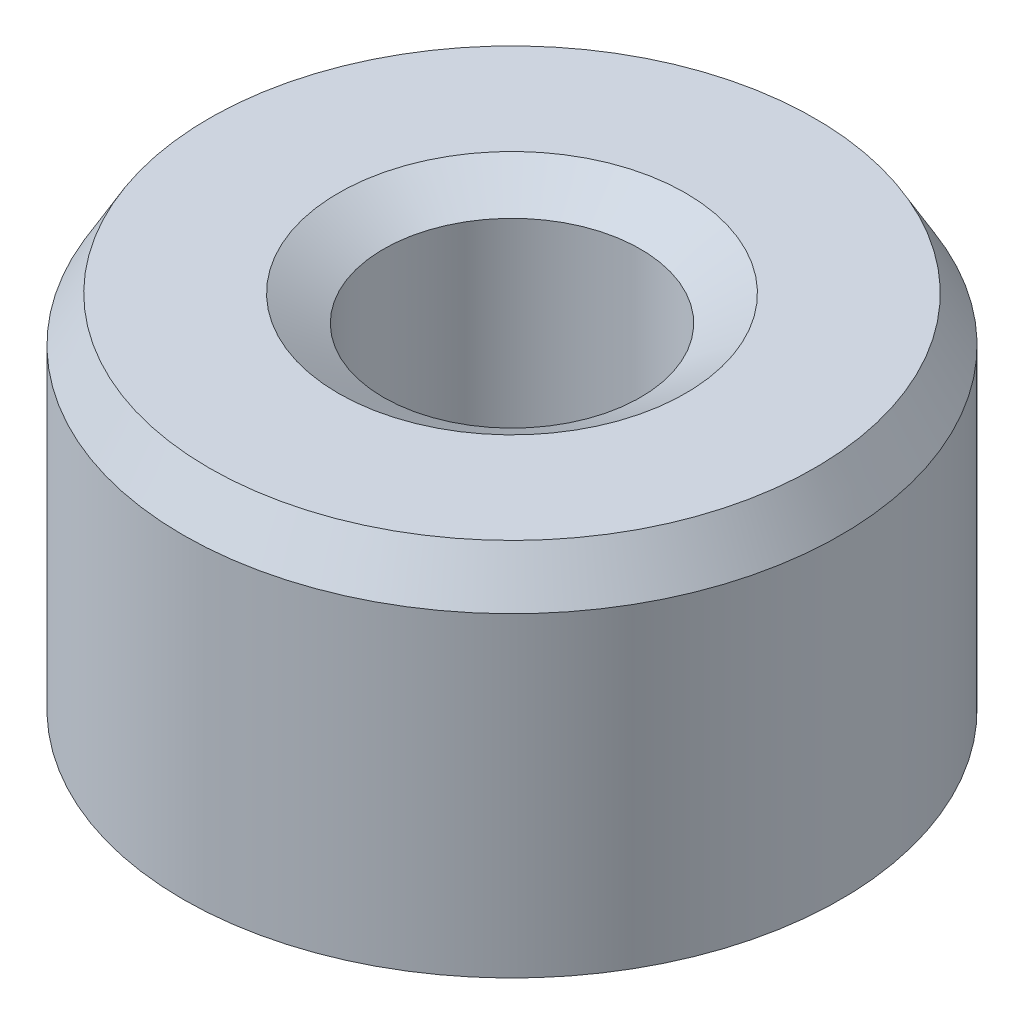
ISO-10303-21;
HEADER;
FILE_DESCRIPTION(('STEP AP214'),'2;1');
FILE_NAME('part.step','',(''),(''),'','','');
FILE_SCHEMA(('AUTOMOTIVE_DESIGN { 1 0 10303 214 1 1 1 1 }'));
ENDSEC;
DATA;
#1=APPLICATION_CONTEXT('core data for automotive mechanical design processes');
#2=APPLICATION_PROTOCOL_DEFINITION('international standard','automotive_design',2000,#1);
#3=PRODUCT_CONTEXT('',#1,'mechanical');
#4=PRODUCT('Part','Part','',(#3));
#5=PRODUCT_RELATED_PRODUCT_CATEGORY('part','',(#4));
#6=PRODUCT_DEFINITION_FORMATION('','',#4);
#7=PRODUCT_DEFINITION_CONTEXT('part definition',#1,'design');
#8=PRODUCT_DEFINITION('design','',#6,#7);
#9=PRODUCT_DEFINITION_SHAPE('','',#8);
#10=(LENGTH_UNIT() NAMED_UNIT(*) SI_UNIT(.MILLI.,.METRE.));
#11=(NAMED_UNIT(*) PLANE_ANGLE_UNIT() SI_UNIT($,.RADIAN.));
#12=(NAMED_UNIT(*) SI_UNIT($,.STERADIAN.) SOLID_ANGLE_UNIT());
#13=UNCERTAINTY_MEASURE_WITH_UNIT(LENGTH_MEASURE(1.E-05),#10,'distance_accuracy_value','');
#14=(GEOMETRIC_REPRESENTATION_CONTEXT(3) GLOBAL_UNCERTAINTY_ASSIGNED_CONTEXT((#13)) GLOBAL_UNIT_ASSIGNED_CONTEXT((#10,
#11,#12)) REPRESENTATION_CONTEXT('',''));
#15=CARTESIAN_POINT('',(0.,0.,0.));
#16=DIRECTION('',(0.,0.,1.));
#17=DIRECTION('',(1.,0.,0.));
#18=AXIS2_PLACEMENT_3D('',#15,#16,#17);
#19=CARTESIAN_POINT('',(0.,32.326275413145,0.));
#20=DIRECTION('',(0.,-1.,0.));
#21=DIRECTION('',(0.,0.,-1.));
#22=AXIS2_PLACEMENT_3D('',#19,#20,#21);
#23=CYLINDRICAL_SURFACE('',#22,27.5);
#24=CARTESIAN_POINT('',(0.,2.17567793763156,0.));
#25=DIRECTION('',(0.,1.,0.));
#26=DIRECTION('',(0.,0.,1.));
#27=AXIS2_PLACEMENT_3D('',#24,#25,#26);
#28=CIRCLE('',#27,27.5);
#29=CARTESIAN_POINT('',(0.,2.17567793763156,27.5));
#30=VERTEX_POINT('',#29);
#31=EDGE_CURVE('E10',#30,#30,#28,.T.);
#32=ORIENTED_EDGE('',*,*,#31,.T.);
#33=EDGE_LOOP('',(#32));
#34=FACE_BOUND('',#33,.T.);
#35=CARTESIAN_POINT('',(0.,28.5578906842604,0.));
#36=DIRECTION('',(0.,1.,0.));
#37=DIRECTION('',(0.,0.,1.));
#38=AXIS2_PLACEMENT_3D('',#35,#36,#37);
#39=CIRCLE('',#38,27.5);
#40=CARTESIAN_POINT('',(0.,28.5578906842604,27.5));
#41=VERTEX_POINT('',#40);
#42=EDGE_CURVE('E50',#41,#41,#39,.F.);
#43=ORIENTED_EDGE('',*,*,#42,.T.);
#44=EDGE_LOOP('',(#43));
#45=FACE_BOUND('',#44,.T.);
#46=ADVANCED_FACE('F39',(#34,#45),#23,.T.);
#47=CARTESIAN_POINT('',(0.,32.326275413145,0.));
#48=DIRECTION('',(0.,1.,0.));
#49=DIRECTION('',(0.,0.,1.));
#50=AXIS2_PLACEMENT_3D('',#47,#48,#49);
#51=PLANE('',#50);
#52=CARTESIAN_POINT('',(0.,32.326275413145,0.));
#53=DIRECTION('',(0.,1.,0.));
#54=DIRECTION('',(0.,0.,1.));
#55=AXIS2_PLACEMENT_3D('',#52,#53,#54);
#56=CIRCLE('',#55,14.5145012517158);
#57=CARTESIAN_POINT('',(0.,32.326275413145,14.5145012517158));
#58=VERTEX_POINT('',#57);
#59=EDGE_CURVE('E58',#58,#58,#56,.F.);
#60=ORIENTED_EDGE('',*,*,#59,.T.);
#61=EDGE_LOOP('',(#60));
#62=FACE_BOUND('',#61,.T.);
#63=CARTESIAN_POINT('',(0.,32.326275413145,0.));
#64=DIRECTION('',(0.,1.,0.));
#65=DIRECTION('',(0.,0.,1.));
#66=AXIS2_PLACEMENT_3D('',#63,#64,#65);
#67=CIRCLE('',#66,25.3243220623684);
#68=CARTESIAN_POINT('',(0.,32.326275413145,25.3243220623684));
#69=VERTEX_POINT('',#68);
#70=EDGE_CURVE('E61',#69,#69,#67,.T.);
#71=ORIENTED_EDGE('',*,*,#70,.T.);
#72=EDGE_LOOP('',(#71));
#73=FACE_BOUND('',#72,.T.);
#74=ADVANCED_FACE('F88',(#62,#73),#51,.T.);
#75=CARTESIAN_POINT('',(0.,0.,0.));
#76=DIRECTION('',(0.,1.,0.));
#77=DIRECTION('',(0.,0.,1.));
#78=AXIS2_PLACEMENT_3D('',#75,#76,#77);
#79=PLANE('',#78);
#80=CARTESIAN_POINT('',(0.,0.,0.));
#81=DIRECTION('',(0.,1.,0.));
#82=DIRECTION('',(0.,0.,1.));
#83=AXIS2_PLACEMENT_3D('',#80,#81,#82);
#84=CIRCLE('',#83,12.9217944604628);
#85=CARTESIAN_POINT('',(0.,0.,12.9217944604628));
#86=VERTEX_POINT('',#85);
#87=EDGE_CURVE('E51',#86,#86,#84,.T.);
#88=ORIENTED_EDGE('',*,*,#87,.T.);
#89=EDGE_LOOP('',(#88));
#90=FACE_BOUND('',#89,.T.);
#91=CARTESIAN_POINT('',(0.,0.,0.));
#92=DIRECTION('',(0.,1.,0.));
#93=DIRECTION('',(0.,0.,1.));
#94=AXIS2_PLACEMENT_3D('',#91,#92,#93);
#95=CIRCLE('',#94,23.7316152711154);
#96=CARTESIAN_POINT('',(0.,0.,23.7316152711154));
#97=VERTEX_POINT('',#96);
#98=EDGE_CURVE('E54',#97,#97,#95,.F.);
#99=ORIENTED_EDGE('',*,*,#98,.T.);
#100=EDGE_LOOP('',(#99));
#101=FACE_BOUND('',#100,.T.);
#102=ADVANCED_FACE('F83',(#90,#101),#79,.F.);
#103=CARTESIAN_POINT('',(0.,32.326275413145,0.));
#104=DIRECTION('',(0.,-1.,0.));
#105=DIRECTION('',(0.,0.,-1.));
#106=AXIS2_PLACEMENT_3D('',#103,#104,#105);
#107=CYLINDRICAL_SURFACE('',#106,10.7461165228312);
#108=CARTESIAN_POINT('',(0.,30.1505974755134,0.));
#109=DIRECTION('',(0.,1.,0.));
#110=DIRECTION('',(0.,0.,1.));
#111=AXIS2_PLACEMENT_3D('',#108,#109,#110);
#112=CIRCLE('',#111,10.7461165228312);
#113=CARTESIAN_POINT('',(0.,30.1505974755134,10.7461165228312));
#114=VERTEX_POINT('',#113);
#115=EDGE_CURVE('E67',#114,#114,#112,.T.);
#116=ORIENTED_EDGE('',*,*,#115,.T.);
#117=EDGE_LOOP('',(#116));
#118=FACE_BOUND('',#117,.T.);
#119=CARTESIAN_POINT('',(0.,3.76838472888458,0.));
#120=DIRECTION('',(0.,1.,0.));
#121=DIRECTION('',(0.,0.,1.));
#122=AXIS2_PLACEMENT_3D('',#119,#120,#121);
#123=CIRCLE('',#122,10.7461165228312);
#124=CARTESIAN_POINT('',(0.,3.76838472888458,10.7461165228312));
#125=VERTEX_POINT('',#124);
#126=EDGE_CURVE('E69',#125,#125,#123,.F.);
#127=ORIENTED_EDGE('',*,*,#126,.T.);
#128=EDGE_LOOP('',(#127));
#129=FACE_BOUND('',#128,.T.);
#130=ADVANCED_FACE('F71',(#118,#129),#107,.F.);
#131=CARTESIAN_POINT('',(0.,30.1505974755134,0.));
#132=DIRECTION('',(0.,1.,0.));
#133=DIRECTION('',(0.,0.,1.));
#134=AXIS2_PLACEMENT_3D('',#131,#132,#133);
#135=CONICAL_SURFACE('',#134,10.7461165228312,1.0471975511966);
#136=ORIENTED_EDGE('',*,*,#59,.F.);
#137=EDGE_LOOP('',(#136));
#138=FACE_BOUND('',#137,.T.);
#139=ORIENTED_EDGE('',*,*,#115,.F.);
#140=EDGE_LOOP('',(#139));
#141=FACE_BOUND('',#140,.T.);
#142=ADVANCED_FACE('F77',(#138,#141),#135,.F.);
#143=CARTESIAN_POINT('',(0.,0.,0.));
#144=DIRECTION('',(0.,-1.,0.));
#145=DIRECTION('',(0.,0.,-1.));
#146=AXIS2_PLACEMENT_3D('',#143,#144,#145);
#147=CONICAL_SURFACE('',#146,12.9217944604628,0.523598775598295);
#148=ORIENTED_EDGE('',*,*,#126,.F.);
#149=EDGE_LOOP('',(#148));
#150=FACE_BOUND('',#149,.T.);
#151=ORIENTED_EDGE('',*,*,#87,.F.);
#152=EDGE_LOOP('',(#151));
#153=FACE_BOUND('',#152,.T.);
#154=ADVANCED_FACE('F73',(#150,#153),#147,.F.);
#155=CARTESIAN_POINT('',(0.,2.17567793763156,0.));
#156=DIRECTION('',(0.,1.,0.));
#157=DIRECTION('',(0.,0.,1.));
#158=AXIS2_PLACEMENT_3D('',#155,#156,#157);
#159=CONICAL_SURFACE('',#158,27.5,1.0471975511966);
#160=ORIENTED_EDGE('',*,*,#98,.F.);
#161=EDGE_LOOP('',(#160));
#162=FACE_BOUND('',#161,.T.);
#163=ORIENTED_EDGE('',*,*,#31,.F.);
#164=EDGE_LOOP('',(#163));
#165=FACE_BOUND('',#164,.T.);
#166=ADVANCED_FACE('F76',(#162,#165),#159,.T.);
#167=CARTESIAN_POINT('',(0.,32.326275413145,0.));
#168=DIRECTION('',(0.,-1.,0.));
#169=DIRECTION('',(0.,0.,-1.));
#170=AXIS2_PLACEMENT_3D('',#167,#168,#169);
#171=CONICAL_SURFACE('',#170,25.3243220623684,0.523598775598292);
#172=ORIENTED_EDGE('',*,*,#42,.F.);
#173=EDGE_LOOP('',(#172));
#174=FACE_BOUND('',#173,.T.);
#175=ORIENTED_EDGE('',*,*,#70,.F.);
#176=EDGE_LOOP('',(#175));
#177=FACE_BOUND('',#176,.T.);
#178=ADVANCED_FACE('F45',(#174,#177),#171,.T.);
#179=CLOSED_SHELL('',(#46,#74,#102,#130,#142,#154,#166,#178));
#180=MANIFOLD_SOLID_BREP('B2',#179);
#181=ADVANCED_BREP_SHAPE_REPRESENTATION('',(#18,#180),#14);
#182=SHAPE_DEFINITION_REPRESENTATION(#9,#181);
ENDSEC;
END-ISO-10303-21;
